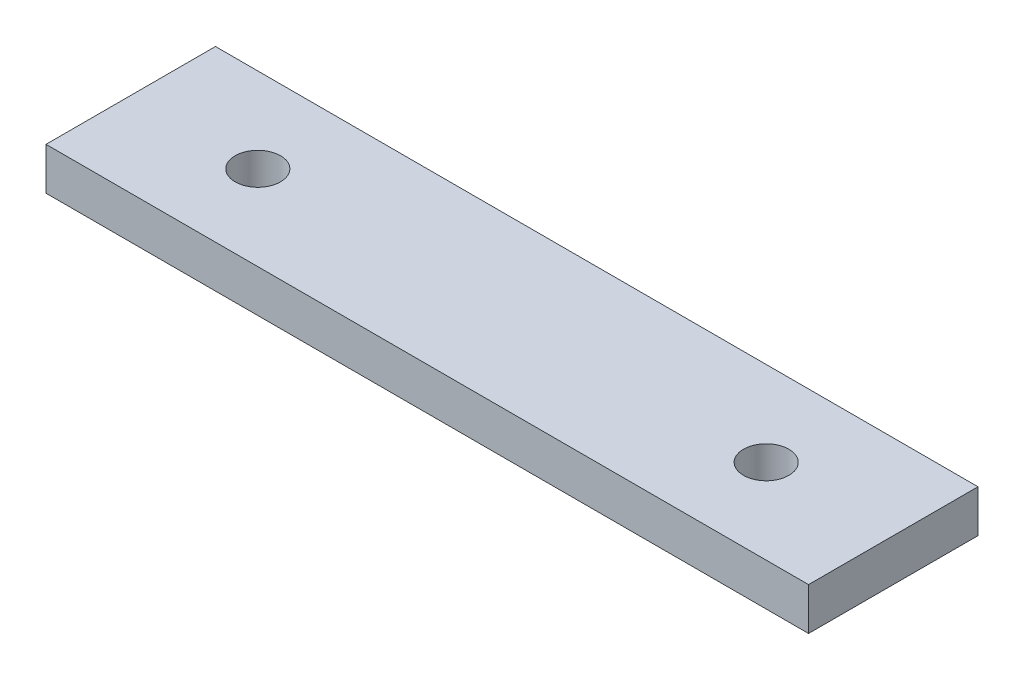
ISO-10303-21;
HEADER;
FILE_DESCRIPTION(('STEP AP214'),'2;1');
FILE_NAME('part.step','',(''),(''),'','','');
FILE_SCHEMA(('AUTOMOTIVE_DESIGN { 1 0 10303 214 1 1 1 1 }'));
ENDSEC;
DATA;
#1=APPLICATION_CONTEXT('core data for automotive mechanical design processes');
#2=APPLICATION_PROTOCOL_DEFINITION('international standard','automotive_design',2000,#1);
#3=PRODUCT_CONTEXT('',#1,'mechanical');
#4=PRODUCT('Part','Part','',(#3));
#5=PRODUCT_RELATED_PRODUCT_CATEGORY('part','',(#4));
#6=PRODUCT_DEFINITION_FORMATION('','',#4);
#7=PRODUCT_DEFINITION_CONTEXT('part definition',#1,'design');
#8=PRODUCT_DEFINITION('design','',#6,#7);
#9=PRODUCT_DEFINITION_SHAPE('','',#8);
#10=(LENGTH_UNIT() NAMED_UNIT(*) SI_UNIT(.MILLI.,.METRE.));
#11=(NAMED_UNIT(*) PLANE_ANGLE_UNIT() SI_UNIT($,.RADIAN.));
#12=(NAMED_UNIT(*) SI_UNIT($,.STERADIAN.) SOLID_ANGLE_UNIT());
#13=UNCERTAINTY_MEASURE_WITH_UNIT(LENGTH_MEASURE(1.E-05),#10,'distance_accuracy_value','');
#14=(GEOMETRIC_REPRESENTATION_CONTEXT(3) GLOBAL_UNCERTAINTY_ASSIGNED_CONTEXT((#13)) GLOBAL_UNIT_ASSIGNED_CONTEXT((#10,
#11,#12)) REPRESENTATION_CONTEXT('',''));
#15=CARTESIAN_POINT('',(0.,0.,0.));
#16=DIRECTION('',(0.,0.,1.));
#17=DIRECTION('',(1.,0.,0.));
#18=AXIS2_PLACEMENT_3D('',#15,#16,#17);
#19=CARTESIAN_POINT('',(0.,6.35,0.));
#20=DIRECTION('',(0.,1.,0.));
#21=DIRECTION('',(0.,0.,1.));
#22=AXIS2_PLACEMENT_3D('',#19,#20,#21);
#23=PLANE('',#22);
#24=CARTESIAN_POINT('',(-38.1,6.35,0.));
#25=DIRECTION('',(0.,1.,0.));
#26=DIRECTION('',(0.,0.,1.));
#27=AXIS2_PLACEMENT_3D('',#24,#25,#26);
#28=CIRCLE('',#27,3.4);
#29=CARTESIAN_POINT('',(-38.1,6.35,3.4));
#30=VERTEX_POINT('',#29);
#31=EDGE_CURVE('E112',#30,#30,#28,.T.);
#32=ORIENTED_EDGE('',*,*,#31,.F.);
#33=EDGE_LOOP('',(#32));
#34=FACE_BOUND('',#33,.T.);
#35=DIRECTION('',(0.,0.,-1.));
#36=VECTOR('',#35,1.);
#37=CARTESIAN_POINT('',(57.15,6.35,-12.7));
#38=LINE('',#37,#36);
#39=CARTESIAN_POINT('',(57.15,6.35,12.7));
#40=VERTEX_POINT('',#39);
#41=CARTESIAN_POINT('',(57.15,6.35,-12.7));
#42=VERTEX_POINT('',#41);
#43=EDGE_CURVE('E92',#40,#42,#38,.T.);
#44=ORIENTED_EDGE('',*,*,#43,.T.);
#45=DIRECTION('',(-1.,0.,0.));
#46=VECTOR('',#45,1.);
#47=CARTESIAN_POINT('',(-57.15,6.35,-12.7));
#48=LINE('',#47,#46);
#49=CARTESIAN_POINT('',(-57.15,6.35,-12.7));
#50=VERTEX_POINT('',#49);
#51=EDGE_CURVE('E87',#42,#50,#48,.T.);
#52=ORIENTED_EDGE('',*,*,#51,.T.);
#53=DIRECTION('',(0.,0.,1.));
#54=VECTOR('',#53,1.);
#55=CARTESIAN_POINT('',(-57.15,6.35,-12.7));
#56=LINE('',#55,#54);
#57=CARTESIAN_POINT('',(-57.15,6.35,12.7));
#58=VERTEX_POINT('',#57);
#59=EDGE_CURVE('E90',#50,#58,#56,.T.);
#60=ORIENTED_EDGE('',*,*,#59,.T.);
#61=DIRECTION('',(1.,0.,0.));
#62=VECTOR('',#61,1.);
#63=CARTESIAN_POINT('',(-57.15,6.35,12.7));
#64=LINE('',#63,#62);
#65=EDGE_CURVE('E57',#58,#40,#64,.T.);
#66=ORIENTED_EDGE('',*,*,#65,.T.);
#67=EDGE_LOOP('',(#44,#52,#60,#66));
#68=FACE_BOUND('',#67,.T.);
#69=CARTESIAN_POINT('',(38.1,6.35,0.));
#70=DIRECTION('',(0.,1.,0.));
#71=DIRECTION('',(0.,0.,1.));
#72=AXIS2_PLACEMENT_3D('',#69,#70,#71);
#73=CIRCLE('',#72,3.4);
#74=CARTESIAN_POINT('',(38.1,6.35,3.39999999999999));
#75=VERTEX_POINT('',#74);
#76=EDGE_CURVE('E134',#75,#75,#73,.T.);
#77=ORIENTED_EDGE('',*,*,#76,.F.);
#78=EDGE_LOOP('',(#77));
#79=FACE_BOUND('',#78,.T.);
#80=ADVANCED_FACE('F39',(#34,#68,#79),#23,.T.);
#81=CARTESIAN_POINT('',(0.,0.,0.));
#82=DIRECTION('',(0.,1.,0.));
#83=DIRECTION('',(0.,0.,1.));
#84=AXIS2_PLACEMENT_3D('',#81,#82,#83);
#85=PLANE('',#84);
#86=DIRECTION('',(0.,0.,-1.));
#87=VECTOR('',#86,1.);
#88=CARTESIAN_POINT('',(57.15,0.,-12.7));
#89=LINE('',#88,#87);
#90=CARTESIAN_POINT('',(57.15,0.,12.7));
#91=VERTEX_POINT('',#90);
#92=CARTESIAN_POINT('',(57.15,0.,-12.7));
#93=VERTEX_POINT('',#92);
#94=EDGE_CURVE('E108',#91,#93,#89,.T.);
#95=ORIENTED_EDGE('',*,*,#94,.F.);
#96=DIRECTION('',(1.,0.,0.));
#97=VECTOR('',#96,1.);
#98=CARTESIAN_POINT('',(-57.15,0.,12.7));
#99=LINE('',#98,#97);
#100=CARTESIAN_POINT('',(-57.15,0.,12.7));
#101=VERTEX_POINT('',#100);
#102=EDGE_CURVE('E80',#101,#91,#99,.T.);
#103=ORIENTED_EDGE('',*,*,#102,.F.);
#104=DIRECTION('',(0.,0.,1.));
#105=VECTOR('',#104,1.);
#106=CARTESIAN_POINT('',(-57.15,0.,-12.7));
#107=LINE('',#106,#105);
#108=CARTESIAN_POINT('',(-57.15,0.,-12.7));
#109=VERTEX_POINT('',#108);
#110=EDGE_CURVE('E74',#109,#101,#107,.T.);
#111=ORIENTED_EDGE('',*,*,#110,.F.);
#112=DIRECTION('',(-1.,0.,0.));
#113=VECTOR('',#112,1.);
#114=CARTESIAN_POINT('',(-57.15,0.,-12.7));
#115=LINE('',#114,#113);
#116=EDGE_CURVE('E97',#93,#109,#115,.T.);
#117=ORIENTED_EDGE('',*,*,#116,.F.);
#118=EDGE_LOOP('',(#95,#103,#111,#117));
#119=FACE_BOUND('',#118,.T.);
#120=CARTESIAN_POINT('',(-38.1,0.,0.));
#121=DIRECTION('',(0.,1.,0.));
#122=DIRECTION('',(0.,0.,1.));
#123=AXIS2_PLACEMENT_3D('',#120,#121,#122);
#124=CIRCLE('',#123,3.4);
#125=CARTESIAN_POINT('',(-38.1,0.,3.4));
#126=VERTEX_POINT('',#125);
#127=EDGE_CURVE('E130',#126,#126,#124,.T.);
#128=ORIENTED_EDGE('',*,*,#127,.T.);
#129=EDGE_LOOP('',(#128));
#130=FACE_BOUND('',#129,.T.);
#131=CARTESIAN_POINT('',(38.1,0.,0.));
#132=DIRECTION('',(0.,1.,0.));
#133=DIRECTION('',(0.,0.,1.));
#134=AXIS2_PLACEMENT_3D('',#131,#132,#133);
#135=CIRCLE('',#134,3.4);
#136=CARTESIAN_POINT('',(38.1,0.,3.39999999999999));
#137=VERTEX_POINT('',#136);
#138=EDGE_CURVE('E138',#137,#137,#135,.T.);
#139=ORIENTED_EDGE('',*,*,#138,.T.);
#140=EDGE_LOOP('',(#139));
#141=FACE_BOUND('',#140,.T.);
#142=ADVANCED_FACE('F125',(#119,#130,#141),#85,.F.);
#143=CARTESIAN_POINT('',(57.15,6.35,-12.7));
#144=DIRECTION('',(-1.,0.,0.));
#145=DIRECTION('',(0.,0.,1.));
#146=AXIS2_PLACEMENT_3D('',#143,#144,#145);
#147=PLANE('',#146);
#148=ORIENTED_EDGE('',*,*,#94,.T.);
#149=DIRECTION('',(0.,-1.,0.));
#150=VECTOR('',#149,1.);
#151=CARTESIAN_POINT('',(57.15,6.35,-12.7));
#152=LINE('',#151,#150);
#153=EDGE_CURVE('E11',#42,#93,#152,.T.);
#154=ORIENTED_EDGE('',*,*,#153,.F.);
#155=ORIENTED_EDGE('',*,*,#43,.F.);
#156=DIRECTION('',(0.,-1.,0.));
#157=VECTOR('',#156,1.);
#158=CARTESIAN_POINT('',(57.15,6.35,12.7));
#159=LINE('',#158,#157);
#160=EDGE_CURVE('E104',#40,#91,#159,.T.);
#161=ORIENTED_EDGE('',*,*,#160,.T.);
#162=EDGE_LOOP('',(#148,#154,#155,#161));
#163=FACE_BOUND('',#162,.T.);
#164=ADVANCED_FACE('F41',(#163),#147,.F.);
#165=CARTESIAN_POINT('',(-57.15,6.35,-12.7));
#166=DIRECTION('',(0.,0.,1.));
#167=DIRECTION('',(1.,0.,0.));
#168=AXIS2_PLACEMENT_3D('',#165,#166,#167);
#169=PLANE('',#168);
#170=ORIENTED_EDGE('',*,*,#116,.T.);
#171=DIRECTION('',(0.,-1.,0.));
#172=VECTOR('',#171,1.);
#173=CARTESIAN_POINT('',(-57.15,6.35,-12.7));
#174=LINE('',#173,#172);
#175=EDGE_CURVE('E49',#50,#109,#174,.T.);
#176=ORIENTED_EDGE('',*,*,#175,.F.);
#177=ORIENTED_EDGE('',*,*,#51,.F.);
#178=ORIENTED_EDGE('',*,*,#153,.T.);
#179=EDGE_LOOP('',(#170,#176,#177,#178));
#180=FACE_BOUND('',#179,.T.);
#181=ADVANCED_FACE('F96',(#180),#169,.F.);
#182=CARTESIAN_POINT('',(-57.15,6.35,-12.7));
#183=DIRECTION('',(1.,0.,0.));
#184=DIRECTION('',(0.,0.,-1.));
#185=AXIS2_PLACEMENT_3D('',#182,#183,#184);
#186=PLANE('',#185);
#187=ORIENTED_EDGE('',*,*,#110,.T.);
#188=DIRECTION('',(0.,-1.,0.));
#189=VECTOR('',#188,1.);
#190=CARTESIAN_POINT('',(-57.15,6.35,12.7));
#191=LINE('',#190,#189);
#192=EDGE_CURVE('E99',#58,#101,#191,.T.);
#193=ORIENTED_EDGE('',*,*,#192,.F.);
#194=ORIENTED_EDGE('',*,*,#59,.F.);
#195=ORIENTED_EDGE('',*,*,#175,.T.);
#196=EDGE_LOOP('',(#187,#193,#194,#195));
#197=FACE_BOUND('',#196,.T.);
#198=ADVANCED_FACE('F100',(#197),#186,.F.);
#199=CARTESIAN_POINT('',(-57.15,6.35,12.7));
#200=DIRECTION('',(0.,0.,-1.));
#201=DIRECTION('',(-1.,0.,0.));
#202=AXIS2_PLACEMENT_3D('',#199,#200,#201);
#203=PLANE('',#202);
#204=ORIENTED_EDGE('',*,*,#102,.T.);
#205=ORIENTED_EDGE('',*,*,#160,.F.);
#206=ORIENTED_EDGE('',*,*,#65,.F.);
#207=ORIENTED_EDGE('',*,*,#192,.T.);
#208=EDGE_LOOP('',(#204,#205,#206,#207));
#209=FACE_BOUND('',#208,.T.);
#210=ADVANCED_FACE('F122',(#209),#203,.F.);
#211=CARTESIAN_POINT('',(-38.1,6.35,0.));
#212=DIRECTION('',(0.,-1.,0.));
#213=DIRECTION('',(0.,0.,-1.));
#214=AXIS2_PLACEMENT_3D('',#211,#212,#213);
#215=CYLINDRICAL_SURFACE('',#214,3.4);
#216=ORIENTED_EDGE('',*,*,#31,.T.);
#217=EDGE_LOOP('',(#216));
#218=FACE_BOUND('',#217,.T.);
#219=ORIENTED_EDGE('',*,*,#127,.F.);
#220=EDGE_LOOP('',(#219));
#221=FACE_BOUND('',#220,.T.);
#222=ADVANCED_FACE('F157',(#218,#221),#215,.F.);
#223=CARTESIAN_POINT('',(38.1,6.35,0.));
#224=DIRECTION('',(0.,-1.,0.));
#225=DIRECTION('',(0.,0.,-1.));
#226=AXIS2_PLACEMENT_3D('',#223,#224,#225);
#227=CYLINDRICAL_SURFACE('',#226,3.4);
#228=ORIENTED_EDGE('',*,*,#76,.T.);
#229=EDGE_LOOP('',(#228));
#230=FACE_BOUND('',#229,.T.);
#231=ORIENTED_EDGE('',*,*,#138,.F.);
#232=EDGE_LOOP('',(#231));
#233=FACE_BOUND('',#232,.T.);
#234=ADVANCED_FACE('F146',(#230,#233),#227,.F.);
#235=CLOSED_SHELL('',(#80,#142,#164,#181,#198,#210,#222,#234));
#236=MANIFOLD_SOLID_BREP('B2',#235);
#237=ADVANCED_BREP_SHAPE_REPRESENTATION('',(#18,#236),#14);
#238=SHAPE_DEFINITION_REPRESENTATION(#9,#237);
ENDSEC;
END-ISO-10303-21;
